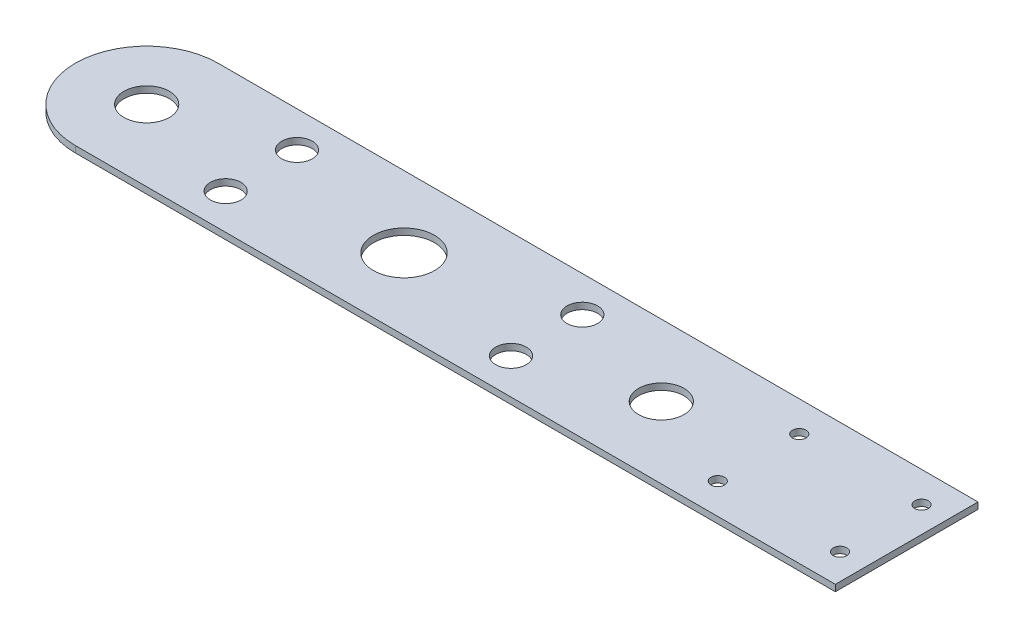
ISO-10303-21;
HEADER;
FILE_DESCRIPTION(('STEP AP214'),'2;1');
FILE_NAME('part.step','',(''),(''),'','','');
FILE_SCHEMA(('AUTOMOTIVE_DESIGN { 1 0 10303 214 1 1 1 1 }'));
ENDSEC;
DATA;
#1=APPLICATION_CONTEXT('core data for automotive mechanical design processes');
#2=APPLICATION_PROTOCOL_DEFINITION('international standard','automotive_design',2000,#1);
#3=PRODUCT_CONTEXT('',#1,'mechanical');
#4=PRODUCT('Part','Part','',(#3));
#5=PRODUCT_RELATED_PRODUCT_CATEGORY('part','',(#4));
#6=PRODUCT_DEFINITION_FORMATION('','',#4);
#7=PRODUCT_DEFINITION_CONTEXT('part definition',#1,'design');
#8=PRODUCT_DEFINITION('design','',#6,#7);
#9=PRODUCT_DEFINITION_SHAPE('','',#8);
#10=(LENGTH_UNIT() NAMED_UNIT(*) SI_UNIT(.MILLI.,.METRE.));
#11=(NAMED_UNIT(*) PLANE_ANGLE_UNIT() SI_UNIT($,.RADIAN.));
#12=(NAMED_UNIT(*) SI_UNIT($,.STERADIAN.) SOLID_ANGLE_UNIT());
#13=UNCERTAINTY_MEASURE_WITH_UNIT(LENGTH_MEASURE(1.E-05),#10,'distance_accuracy_value','');
#14=(GEOMETRIC_REPRESENTATION_CONTEXT(3) GLOBAL_UNCERTAINTY_ASSIGNED_CONTEXT((#13)) GLOBAL_UNIT_ASSIGNED_CONTEXT((#10,
#11,#12)) REPRESENTATION_CONTEXT('',''));
#15=CARTESIAN_POINT('',(0.,0.,0.));
#16=DIRECTION('',(0.,0.,1.));
#17=DIRECTION('',(1.,0.,0.));
#18=AXIS2_PLACEMENT_3D('',#15,#16,#17);
#19=CARTESIAN_POINT('',(0.,3.175,-35.0000000000003));
#20=DIRECTION('',(0.,0.,-1.));
#21=DIRECTION('',(-1.,0.,0.));
#22=AXIS2_PLACEMENT_3D('',#19,#20,#21);
#23=PLANE('',#22);
#24=DIRECTION('',(1.,0.,0.));
#25=VECTOR('',#24,1.);
#26=CARTESIAN_POINT('',(0.,0.,-35.0000000000003));
#27=LINE('',#26,#25);
#28=CARTESIAN_POINT('',(-126.258214395413,0.,-35.0000000000012));
#29=VERTEX_POINT('',#28);
#30=CARTESIAN_POINT('',(246.658214395413,0.,-35.));
#31=VERTEX_POINT('',#30);
#32=EDGE_CURVE('E138',#29,#31,#27,.T.);
#33=ORIENTED_EDGE('',*,*,#32,.F.);
#34=DIRECTION('',(0.,-1.,0.));
#35=VECTOR('',#34,1.);
#36=CARTESIAN_POINT('',(-126.258214395413,3.175,-35.0000000000012));
#37=LINE('',#36,#35);
#38=CARTESIAN_POINT('',(-126.258214395413,3.175,-35.0000000000012));
#39=VERTEX_POINT('',#38);
#40=EDGE_CURVE('E11',#39,#29,#37,.T.);
#41=ORIENTED_EDGE('',*,*,#40,.F.);
#42=DIRECTION('',(1.,0.,0.));
#43=VECTOR('',#42,1.);
#44=CARTESIAN_POINT('',(0.,3.175,-35.0000000000003));
#45=LINE('',#44,#43);
#46=CARTESIAN_POINT('',(246.658214395413,3.175,-35.));
#47=VERTEX_POINT('',#46);
#48=EDGE_CURVE('E91',#39,#47,#45,.T.);
#49=ORIENTED_EDGE('',*,*,#48,.T.);
#50=DIRECTION('',(0.,-1.,0.));
#51=VECTOR('',#50,1.);
#52=CARTESIAN_POINT('',(246.658214395413,3.175,-35.));
#53=LINE('',#52,#51);
#54=EDGE_CURVE('E52',#47,#31,#53,.T.);
#55=ORIENTED_EDGE('',*,*,#54,.T.);
#56=EDGE_LOOP('',(#33,#41,#49,#55));
#57=FACE_BOUND('',#56,.T.);
#58=ADVANCED_FACE('F35',(#57),#23,.T.);
#59=CARTESIAN_POINT('',(-126.258214395413,3.175,-2.40182936781888E-12));
#60=DIRECTION('',(0.,-1.,0.));
#61=DIRECTION('',(0.,0.,-1.));
#62=AXIS2_PLACEMENT_3D('',#59,#60,#61);
#63=CYLINDRICAL_SURFACE('',#62,35.);
#64=CARTESIAN_POINT('',(-126.258214395413,0.,-2.40182936781888E-12));
#65=DIRECTION('',(0.,1.,0.));
#66=DIRECTION('',(0.,0.,1.));
#67=AXIS2_PLACEMENT_3D('',#64,#65,#66);
#68=CIRCLE('',#67,35.);
#69=CARTESIAN_POINT('',(-126.258214395413,0.,34.9999999999988));
#70=VERTEX_POINT('',#69);
#71=EDGE_CURVE('E96',#29,#70,#68,.T.);
#72=ORIENTED_EDGE('',*,*,#71,.T.);
#73=DIRECTION('',(0.,-1.,0.));
#74=VECTOR('',#73,1.);
#75=CARTESIAN_POINT('',(-126.258214395413,3.175,34.9999999999988));
#76=LINE('',#75,#74);
#77=CARTESIAN_POINT('',(-126.258214395413,3.175,34.9999999999988));
#78=VERTEX_POINT('',#77);
#79=EDGE_CURVE('E44',#78,#70,#76,.T.);
#80=ORIENTED_EDGE('',*,*,#79,.F.);
#81=CARTESIAN_POINT('',(-126.258214395413,3.175,-2.40182936781888E-12));
#82=DIRECTION('',(0.,1.,0.));
#83=DIRECTION('',(0.,0.,1.));
#84=AXIS2_PLACEMENT_3D('',#81,#82,#83);
#85=CIRCLE('',#84,35.);
#86=EDGE_CURVE('E86',#39,#78,#85,.T.);
#87=ORIENTED_EDGE('',*,*,#86,.F.);
#88=ORIENTED_EDGE('',*,*,#40,.T.);
#89=EDGE_LOOP('',(#72,#80,#87,#88));
#90=FACE_BOUND('',#89,.T.);
#91=ADVANCED_FACE('F94',(#90),#63,.T.);
#92=CARTESIAN_POINT('',(0.,3.175,35.));
#93=DIRECTION('',(0.,0.,-1.));
#94=DIRECTION('',(-1.,0.,0.));
#95=AXIS2_PLACEMENT_3D('',#92,#93,#94);
#96=PLANE('',#95);
#97=DIRECTION('',(1.,0.,0.));
#98=VECTOR('',#97,1.);
#99=CARTESIAN_POINT('',(0.,0.,35.));
#100=LINE('',#99,#98);
#101=CARTESIAN_POINT('',(246.658214395413,0.,35.));
#102=VERTEX_POINT('',#101);
#103=EDGE_CURVE('E135',#70,#102,#100,.T.);
#104=ORIENTED_EDGE('',*,*,#103,.T.);
#105=DIRECTION('',(0.,-1.,0.));
#106=VECTOR('',#105,1.);
#107=CARTESIAN_POINT('',(246.658214395413,3.175,35.));
#108=LINE('',#107,#106);
#109=CARTESIAN_POINT('',(246.658214395413,3.175,35.));
#110=VERTEX_POINT('',#109);
#111=EDGE_CURVE('E66',#110,#102,#108,.T.);
#112=ORIENTED_EDGE('',*,*,#111,.F.);
#113=DIRECTION('',(1.,0.,0.));
#114=VECTOR('',#113,1.);
#115=CARTESIAN_POINT('',(0.,3.175,35.));
#116=LINE('',#115,#114);
#117=EDGE_CURVE('E78',#78,#110,#116,.T.);
#118=ORIENTED_EDGE('',*,*,#117,.F.);
#119=ORIENTED_EDGE('',*,*,#79,.T.);
#120=EDGE_LOOP('',(#104,#112,#118,#119));
#121=FACE_BOUND('',#120,.T.);
#122=ADVANCED_FACE('F80',(#121),#96,.F.);
#123=CARTESIAN_POINT('',(126.258214395413,3.175,-2.4482158832565E-12));
#124=DIRECTION('',(0.,-1.,0.));
#125=DIRECTION('',(0.,0.,-1.));
#126=AXIS2_PLACEMENT_3D('',#123,#124,#125);
#127=CYLINDRICAL_SURFACE('',#126,11.15);
#128=CARTESIAN_POINT('',(126.258214395413,3.175,-2.4482158832565E-12));
#129=DIRECTION('',(0.,1.,0.));
#130=DIRECTION('',(0.,0.,1.));
#131=AXIS2_PLACEMENT_3D('',#128,#129,#130);
#132=CIRCLE('',#131,11.15);
#133=CARTESIAN_POINT('',(126.258214395413,3.175,11.1499999999975));
#134=VERTEX_POINT('',#133);
#135=EDGE_CURVE('E145',#134,#134,#132,.T.);
#136=ORIENTED_EDGE('',*,*,#135,.T.);
#137=EDGE_LOOP('',(#136));
#138=FACE_BOUND('',#137,.T.);
#139=CARTESIAN_POINT('',(126.258214395413,0.,-2.4482158832565E-12));
#140=DIRECTION('',(0.,1.,0.));
#141=DIRECTION('',(0.,0.,1.));
#142=AXIS2_PLACEMENT_3D('',#139,#140,#141);
#143=CIRCLE('',#142,11.15);
#144=CARTESIAN_POINT('',(126.258214395413,0.,11.1499999999975));
#145=VERTEX_POINT('',#144);
#146=EDGE_CURVE('E105',#145,#145,#143,.T.);
#147=ORIENTED_EDGE('',*,*,#146,.F.);
#148=EDGE_LOOP('',(#147));
#149=FACE_BOUND('',#148,.T.);
#150=ADVANCED_FACE('F199',(#138,#149),#127,.F.);
#151=CARTESIAN_POINT('',(-70.,3.175,17.5));
#152=DIRECTION('',(0.,-1.,0.));
#153=DIRECTION('',(0.,0.,-1.));
#154=AXIS2_PLACEMENT_3D('',#151,#152,#153);
#155=CYLINDRICAL_SURFACE('',#154,7.50000000000001);
#156=CARTESIAN_POINT('',(-70.,3.175,17.5));
#157=DIRECTION('',(0.,1.,0.));
#158=DIRECTION('',(0.,0.,1.));
#159=AXIS2_PLACEMENT_3D('',#156,#157,#158);
#160=CIRCLE('',#159,7.50000000000001);
#161=CARTESIAN_POINT('',(-70.,3.175,25.));
#162=VERTEX_POINT('',#161);
#163=EDGE_CURVE('E148',#162,#162,#160,.T.);
#164=ORIENTED_EDGE('',*,*,#163,.T.);
#165=EDGE_LOOP('',(#164));
#166=FACE_BOUND('',#165,.T.);
#167=CARTESIAN_POINT('',(-70.,0.,17.5));
#168=DIRECTION('',(0.,1.,0.));
#169=DIRECTION('',(0.,0.,1.));
#170=AXIS2_PLACEMENT_3D('',#167,#168,#169);
#171=CIRCLE('',#170,7.50000000000001);
#172=CARTESIAN_POINT('',(-70.,0.,25.));
#173=VERTEX_POINT('',#172);
#174=EDGE_CURVE('E108',#173,#173,#171,.T.);
#175=ORIENTED_EDGE('',*,*,#174,.F.);
#176=EDGE_LOOP('',(#175));
#177=FACE_BOUND('',#176,.T.);
#178=ADVANCED_FACE('F230',(#166,#177),#155,.F.);
#179=CARTESIAN_POINT('',(-70.,3.175,-17.5));
#180=DIRECTION('',(0.,-1.,0.));
#181=DIRECTION('',(0.,0.,-1.));
#182=AXIS2_PLACEMENT_3D('',#179,#180,#181);
#183=CYLINDRICAL_SURFACE('',#182,7.50000000000001);
#184=CARTESIAN_POINT('',(-70.,3.175,-17.5));
#185=DIRECTION('',(0.,1.,0.));
#186=DIRECTION('',(0.,0.,1.));
#187=AXIS2_PLACEMENT_3D('',#184,#185,#186);
#188=CIRCLE('',#187,7.50000000000001);
#189=CARTESIAN_POINT('',(-70.,3.175,-9.99999999999999));
#190=VERTEX_POINT('',#189);
#191=EDGE_CURVE('E151',#190,#190,#188,.T.);
#192=ORIENTED_EDGE('',*,*,#191,.T.);
#193=EDGE_LOOP('',(#192));
#194=FACE_BOUND('',#193,.T.);
#195=CARTESIAN_POINT('',(-70.,0.,-17.5));
#196=DIRECTION('',(0.,1.,0.));
#197=DIRECTION('',(0.,0.,1.));
#198=AXIS2_PLACEMENT_3D('',#195,#196,#197);
#199=CIRCLE('',#198,7.50000000000001);
#200=CARTESIAN_POINT('',(-70.,0.,-9.99999999999999));
#201=VERTEX_POINT('',#200);
#202=EDGE_CURVE('E111',#201,#201,#199,.T.);
#203=ORIENTED_EDGE('',*,*,#202,.F.);
#204=EDGE_LOOP('',(#203));
#205=FACE_BOUND('',#204,.T.);
#206=ADVANCED_FACE('F226',(#194,#205),#183,.F.);
#207=CARTESIAN_POINT('',(70.,3.175,-17.5));
#208=DIRECTION('',(0.,-1.,0.));
#209=DIRECTION('',(0.,0.,-1.));
#210=AXIS2_PLACEMENT_3D('',#207,#208,#209);
#211=CYLINDRICAL_SURFACE('',#210,7.50000000000001);
#212=CARTESIAN_POINT('',(70.,3.175,-17.5));
#213=DIRECTION('',(0.,1.,0.));
#214=DIRECTION('',(0.,0.,1.));
#215=AXIS2_PLACEMENT_3D('',#212,#213,#214);
#216=CIRCLE('',#215,7.50000000000001);
#217=CARTESIAN_POINT('',(70.,3.175,-10.));
#218=VERTEX_POINT('',#217);
#219=EDGE_CURVE('E154',#218,#218,#216,.T.);
#220=ORIENTED_EDGE('',*,*,#219,.T.);
#221=EDGE_LOOP('',(#220));
#222=FACE_BOUND('',#221,.T.);
#223=CARTESIAN_POINT('',(70.,0.,-17.5));
#224=DIRECTION('',(0.,1.,0.));
#225=DIRECTION('',(0.,0.,1.));
#226=AXIS2_PLACEMENT_3D('',#223,#224,#225);
#227=CIRCLE('',#226,7.50000000000001);
#228=CARTESIAN_POINT('',(70.,0.,-10.));
#229=VERTEX_POINT('',#228);
#230=EDGE_CURVE('E114',#229,#229,#227,.T.);
#231=ORIENTED_EDGE('',*,*,#230,.F.);
#232=EDGE_LOOP('',(#231));
#233=FACE_BOUND('',#232,.T.);
#234=ADVANCED_FACE('F222',(#222,#233),#211,.F.);
#235=CARTESIAN_POINT('',(70.,3.175,17.5));
#236=DIRECTION('',(0.,-1.,0.));
#237=DIRECTION('',(0.,0.,-1.));
#238=AXIS2_PLACEMENT_3D('',#235,#236,#237);
#239=CYLINDRICAL_SURFACE('',#238,7.50000000000001);
#240=CARTESIAN_POINT('',(70.,3.175,17.5));
#241=DIRECTION('',(0.,1.,0.));
#242=DIRECTION('',(0.,0.,1.));
#243=AXIS2_PLACEMENT_3D('',#240,#241,#242);
#244=CIRCLE('',#243,7.50000000000001);
#245=CARTESIAN_POINT('',(70.,3.175,25.));
#246=VERTEX_POINT('',#245);
#247=EDGE_CURVE('E157',#246,#246,#244,.T.);
#248=ORIENTED_EDGE('',*,*,#247,.T.);
#249=EDGE_LOOP('',(#248));
#250=FACE_BOUND('',#249,.T.);
#251=CARTESIAN_POINT('',(70.,0.,17.5));
#252=DIRECTION('',(0.,1.,0.));
#253=DIRECTION('',(0.,0.,1.));
#254=AXIS2_PLACEMENT_3D('',#251,#252,#253);
#255=CIRCLE('',#254,7.50000000000001);
#256=CARTESIAN_POINT('',(70.,0.,25.));
#257=VERTEX_POINT('',#256);
#258=EDGE_CURVE('E117',#257,#257,#255,.T.);
#259=ORIENTED_EDGE('',*,*,#258,.F.);
#260=EDGE_LOOP('',(#259));
#261=FACE_BOUND('',#260,.T.);
#262=ADVANCED_FACE('F218',(#250,#261),#239,.F.);
#263=CARTESIAN_POINT('',(233.958214395413,3.175,20.));
#264=DIRECTION('',(0.,-1.,0.));
#265=DIRECTION('',(0.,0.,-1.));
#266=AXIS2_PLACEMENT_3D('',#263,#264,#265);
#267=CYLINDRICAL_SURFACE('',#266,3.32499999999999);
#268=CARTESIAN_POINT('',(233.958214395413,3.175,20.));
#269=DIRECTION('',(0.,1.,0.));
#270=DIRECTION('',(0.,0.,1.));
#271=AXIS2_PLACEMENT_3D('',#268,#269,#270);
#272=CIRCLE('',#271,3.32499999999999);
#273=CARTESIAN_POINT('',(233.958214395413,3.175,23.325));
#274=VERTEX_POINT('',#273);
#275=EDGE_CURVE('E160',#274,#274,#272,.T.);
#276=ORIENTED_EDGE('',*,*,#275,.T.);
#277=EDGE_LOOP('',(#276));
#278=FACE_BOUND('',#277,.T.);
#279=CARTESIAN_POINT('',(233.958214395413,0.,20.));
#280=DIRECTION('',(0.,1.,0.));
#281=DIRECTION('',(0.,0.,1.));
#282=AXIS2_PLACEMENT_3D('',#279,#280,#281);
#283=CIRCLE('',#282,3.32499999999999);
#284=CARTESIAN_POINT('',(233.958214395413,0.,23.325));
#285=VERTEX_POINT('',#284);
#286=EDGE_CURVE('E120',#285,#285,#283,.T.);
#287=ORIENTED_EDGE('',*,*,#286,.F.);
#288=EDGE_LOOP('',(#287));
#289=FACE_BOUND('',#288,.T.);
#290=ADVANCED_FACE('F214',(#278,#289),#267,.F.);
#291=CARTESIAN_POINT('',(233.958214395413,3.175,-20.));
#292=DIRECTION('',(0.,-1.,0.));
#293=DIRECTION('',(0.,0.,-1.));
#294=AXIS2_PLACEMENT_3D('',#291,#292,#293);
#295=CYLINDRICAL_SURFACE('',#294,3.32499999999999);
#296=CARTESIAN_POINT('',(233.958214395413,3.175,-20.));
#297=DIRECTION('',(0.,1.,0.));
#298=DIRECTION('',(0.,0.,1.));
#299=AXIS2_PLACEMENT_3D('',#296,#297,#298);
#300=CIRCLE('',#299,3.32499999999999);
#301=CARTESIAN_POINT('',(233.958214395413,3.175,-16.675));
#302=VERTEX_POINT('',#301);
#303=EDGE_CURVE('E163',#302,#302,#300,.T.);
#304=ORIENTED_EDGE('',*,*,#303,.T.);
#305=EDGE_LOOP('',(#304));
#306=FACE_BOUND('',#305,.T.);
#307=CARTESIAN_POINT('',(233.958214395413,0.,-20.));
#308=DIRECTION('',(0.,1.,0.));
#309=DIRECTION('',(0.,0.,1.));
#310=AXIS2_PLACEMENT_3D('',#307,#308,#309);
#311=CIRCLE('',#310,3.32499999999999);
#312=CARTESIAN_POINT('',(233.958214395413,0.,-16.675));
#313=VERTEX_POINT('',#312);
#314=EDGE_CURVE('E123',#313,#313,#311,.T.);
#315=ORIENTED_EDGE('',*,*,#314,.F.);
#316=EDGE_LOOP('',(#315));
#317=FACE_BOUND('',#316,.T.);
#318=ADVANCED_FACE('F210',(#306,#317),#295,.F.);
#319=CARTESIAN_POINT('',(173.958214395413,3.175,-20.));
#320=DIRECTION('',(0.,-1.,0.));
#321=DIRECTION('',(0.,0.,-1.));
#322=AXIS2_PLACEMENT_3D('',#319,#320,#321);
#323=CYLINDRICAL_SURFACE('',#322,3.32499999999999);
#324=CARTESIAN_POINT('',(173.958214395413,3.175,-20.));
#325=DIRECTION('',(0.,1.,0.));
#326=DIRECTION('',(0.,0.,1.));
#327=AXIS2_PLACEMENT_3D('',#324,#325,#326);
#328=CIRCLE('',#327,3.32499999999999);
#329=CARTESIAN_POINT('',(173.958214395413,3.175,-16.675));
#330=VERTEX_POINT('',#329);
#331=EDGE_CURVE('E166',#330,#330,#328,.T.);
#332=ORIENTED_EDGE('',*,*,#331,.T.);
#333=EDGE_LOOP('',(#332));
#334=FACE_BOUND('',#333,.T.);
#335=CARTESIAN_POINT('',(173.958214395413,0.,-20.));
#336=DIRECTION('',(0.,1.,0.));
#337=DIRECTION('',(0.,0.,1.));
#338=AXIS2_PLACEMENT_3D('',#335,#336,#337);
#339=CIRCLE('',#338,3.32499999999999);
#340=CARTESIAN_POINT('',(173.958214395413,0.,-16.675));
#341=VERTEX_POINT('',#340);
#342=EDGE_CURVE('E126',#341,#341,#339,.T.);
#343=ORIENTED_EDGE('',*,*,#342,.F.);
#344=EDGE_LOOP('',(#343));
#345=FACE_BOUND('',#344,.T.);
#346=ADVANCED_FACE('F206',(#334,#345),#323,.F.);
#347=CARTESIAN_POINT('',(173.958214395413,3.175,20.));
#348=DIRECTION('',(0.,-1.,0.));
#349=DIRECTION('',(0.,0.,-1.));
#350=AXIS2_PLACEMENT_3D('',#347,#348,#349);
#351=CYLINDRICAL_SURFACE('',#350,3.32499999999999);
#352=CARTESIAN_POINT('',(173.958214395413,3.175,20.));
#353=DIRECTION('',(0.,1.,0.));
#354=DIRECTION('',(0.,0.,1.));
#355=AXIS2_PLACEMENT_3D('',#352,#353,#354);
#356=CIRCLE('',#355,3.32499999999999);
#357=CARTESIAN_POINT('',(173.958214395413,3.175,23.325));
#358=VERTEX_POINT('',#357);
#359=EDGE_CURVE('E169',#358,#358,#356,.T.);
#360=ORIENTED_EDGE('',*,*,#359,.T.);
#361=EDGE_LOOP('',(#360));
#362=FACE_BOUND('',#361,.T.);
#363=CARTESIAN_POINT('',(173.958214395413,0.,20.));
#364=DIRECTION('',(0.,1.,0.));
#365=DIRECTION('',(0.,0.,1.));
#366=AXIS2_PLACEMENT_3D('',#363,#364,#365);
#367=CIRCLE('',#366,3.32499999999999);
#368=CARTESIAN_POINT('',(173.958214395413,0.,23.325));
#369=VERTEX_POINT('',#368);
#370=EDGE_CURVE('E129',#369,#369,#367,.T.);
#371=ORIENTED_EDGE('',*,*,#370,.F.);
#372=EDGE_LOOP('',(#371));
#373=FACE_BOUND('',#372,.T.);
#374=ADVANCED_FACE('F203',(#362,#373),#351,.F.);
#375=CARTESIAN_POINT('',(246.658214395413,3.175,0.));
#376=DIRECTION('',(1.,0.,0.));
#377=DIRECTION('',(0.,0.,-1.));
#378=AXIS2_PLACEMENT_3D('',#375,#376,#377);
#379=PLANE('',#378);
#380=DIRECTION('',(0.,0.,1.));
#381=VECTOR('',#380,1.);
#382=CARTESIAN_POINT('',(246.658214395413,0.,0.));
#383=LINE('',#382,#381);
#384=EDGE_CURVE('E132',#31,#102,#383,.T.);
#385=ORIENTED_EDGE('',*,*,#384,.F.);
#386=ORIENTED_EDGE('',*,*,#54,.F.);
#387=DIRECTION('',(0.,0.,1.));
#388=VECTOR('',#387,1.);
#389=CARTESIAN_POINT('',(246.658214395413,3.175,0.));
#390=LINE('',#389,#388);
#391=EDGE_CURVE('E85',#47,#110,#390,.T.);
#392=ORIENTED_EDGE('',*,*,#391,.T.);
#393=ORIENTED_EDGE('',*,*,#111,.T.);
#394=EDGE_LOOP('',(#385,#386,#392,#393));
#395=FACE_BOUND('',#394,.T.);
#396=ADVANCED_FACE('F200',(#395),#379,.T.);
#397=CARTESIAN_POINT('',(0.,3.175,0.));
#398=DIRECTION('',(0.,-1.,0.));
#399=DIRECTION('',(0.,0.,-1.));
#400=AXIS2_PLACEMENT_3D('',#397,#398,#399);
#401=CYLINDRICAL_SURFACE('',#400,15.);
#402=CARTESIAN_POINT('',(0.,3.175,0.));
#403=DIRECTION('',(0.,1.,0.));
#404=DIRECTION('',(0.,0.,1.));
#405=AXIS2_PLACEMENT_3D('',#402,#403,#404);
#406=CIRCLE('',#405,15.);
#407=CARTESIAN_POINT('',(0.,3.175,15.));
#408=VERTEX_POINT('',#407);
#409=EDGE_CURVE('E104',#408,#408,#406,.T.);
#410=ORIENTED_EDGE('',*,*,#409,.T.);
#411=EDGE_LOOP('',(#410));
#412=FACE_BOUND('',#411,.T.);
#413=CARTESIAN_POINT('',(0.,0.,0.));
#414=DIRECTION('',(0.,1.,0.));
#415=DIRECTION('',(0.,0.,1.));
#416=AXIS2_PLACEMENT_3D('',#413,#414,#415);
#417=CIRCLE('',#416,15.);
#418=CARTESIAN_POINT('',(0.,0.,15.));
#419=VERTEX_POINT('',#418);
#420=EDGE_CURVE('E140',#419,#419,#417,.T.);
#421=ORIENTED_EDGE('',*,*,#420,.F.);
#422=EDGE_LOOP('',(#421));
#423=FACE_BOUND('',#422,.T.);
#424=ADVANCED_FACE('F37',(#412,#423),#401,.F.);
#425=CARTESIAN_POINT('',(-126.258214395413,3.175,-2.40182936781888E-12));
#426=DIRECTION('',(0.,-1.,0.));
#427=DIRECTION('',(0.,0.,-1.));
#428=AXIS2_PLACEMENT_3D('',#425,#426,#427);
#429=CYLINDRICAL_SURFACE('',#428,11.15);
#430=CARTESIAN_POINT('',(-126.258214395413,3.175,-2.40182936781888E-12));
#431=DIRECTION('',(0.,1.,0.));
#432=DIRECTION('',(0.,0.,1.));
#433=AXIS2_PLACEMENT_3D('',#430,#431,#432);
#434=CIRCLE('',#433,11.15);
#435=CARTESIAN_POINT('',(-126.258214395413,3.175,11.1499999999976));
#436=VERTEX_POINT('',#435);
#437=EDGE_CURVE('E100',#436,#436,#434,.T.);
#438=ORIENTED_EDGE('',*,*,#437,.T.);
#439=EDGE_LOOP('',(#438));
#440=FACE_BOUND('',#439,.T.);
#441=CARTESIAN_POINT('',(-126.258214395413,0.,-2.40182936781888E-12));
#442=DIRECTION('',(0.,1.,0.));
#443=DIRECTION('',(0.,0.,1.));
#444=AXIS2_PLACEMENT_3D('',#441,#442,#443);
#445=CIRCLE('',#444,11.15);
#446=CARTESIAN_POINT('',(-126.258214395413,0.,11.1499999999976));
#447=VERTEX_POINT('',#446);
#448=EDGE_CURVE('E101',#447,#447,#445,.T.);
#449=ORIENTED_EDGE('',*,*,#448,.F.);
#450=EDGE_LOOP('',(#449));
#451=FACE_BOUND('',#450,.T.);
#452=ADVANCED_FACE('F181',(#440,#451),#429,.F.);
#453=CARTESIAN_POINT('',(0.,3.175,0.));
#454=DIRECTION('',(0.,1.,0.));
#455=DIRECTION('',(0.,0.,1.));
#456=AXIS2_PLACEMENT_3D('',#453,#454,#455);
#457=PLANE('',#456);
#458=ORIENTED_EDGE('',*,*,#409,.F.);
#459=EDGE_LOOP('',(#458));
#460=FACE_BOUND('',#459,.T.);
#461=ORIENTED_EDGE('',*,*,#48,.F.);
#462=ORIENTED_EDGE('',*,*,#86,.T.);
#463=ORIENTED_EDGE('',*,*,#117,.T.);
#464=ORIENTED_EDGE('',*,*,#391,.F.);
#465=EDGE_LOOP('',(#461,#462,#463,#464));
#466=FACE_BOUND('',#465,.T.);
#467=ORIENTED_EDGE('',*,*,#359,.F.);
#468=EDGE_LOOP('',(#467));
#469=FACE_BOUND('',#468,.T.);
#470=ORIENTED_EDGE('',*,*,#331,.F.);
#471=EDGE_LOOP('',(#470));
#472=FACE_BOUND('',#471,.T.);
#473=ORIENTED_EDGE('',*,*,#303,.F.);
#474=EDGE_LOOP('',(#473));
#475=FACE_BOUND('',#474,.T.);
#476=ORIENTED_EDGE('',*,*,#275,.F.);
#477=EDGE_LOOP('',(#476));
#478=FACE_BOUND('',#477,.T.);
#479=ORIENTED_EDGE('',*,*,#247,.F.);
#480=EDGE_LOOP('',(#479));
#481=FACE_BOUND('',#480,.T.);
#482=ORIENTED_EDGE('',*,*,#219,.F.);
#483=EDGE_LOOP('',(#482));
#484=FACE_BOUND('',#483,.T.);
#485=ORIENTED_EDGE('',*,*,#191,.F.);
#486=EDGE_LOOP('',(#485));
#487=FACE_BOUND('',#486,.T.);
#488=ORIENTED_EDGE('',*,*,#163,.F.);
#489=EDGE_LOOP('',(#488));
#490=FACE_BOUND('',#489,.T.);
#491=ORIENTED_EDGE('',*,*,#135,.F.);
#492=EDGE_LOOP('',(#491));
#493=FACE_BOUND('',#492,.T.);
#494=ORIENTED_EDGE('',*,*,#437,.F.);
#495=EDGE_LOOP('',(#494));
#496=FACE_BOUND('',#495,.T.);
#497=ADVANCED_FACE('F89',(#460,#466,#469,#472,#475,#478,#481,#484,#487,#490,#493,#496),#457,.T.);
#498=CARTESIAN_POINT('',(0.,0.,0.));
#499=DIRECTION('',(0.,1.,0.));
#500=DIRECTION('',(0.,0.,1.));
#501=AXIS2_PLACEMENT_3D('',#498,#499,#500);
#502=PLANE('',#501);
#503=ORIENTED_EDGE('',*,*,#420,.T.);
#504=EDGE_LOOP('',(#503));
#505=FACE_BOUND('',#504,.T.);
#506=ORIENTED_EDGE('',*,*,#32,.T.);
#507=ORIENTED_EDGE('',*,*,#384,.T.);
#508=ORIENTED_EDGE('',*,*,#103,.F.);
#509=ORIENTED_EDGE('',*,*,#71,.F.);
#510=EDGE_LOOP('',(#506,#507,#508,#509));
#511=FACE_BOUND('',#510,.T.);
#512=ORIENTED_EDGE('',*,*,#370,.T.);
#513=EDGE_LOOP('',(#512));
#514=FACE_BOUND('',#513,.T.);
#515=ORIENTED_EDGE('',*,*,#342,.T.);
#516=EDGE_LOOP('',(#515));
#517=FACE_BOUND('',#516,.T.);
#518=ORIENTED_EDGE('',*,*,#314,.T.);
#519=EDGE_LOOP('',(#518));
#520=FACE_BOUND('',#519,.T.);
#521=ORIENTED_EDGE('',*,*,#286,.T.);
#522=EDGE_LOOP('',(#521));
#523=FACE_BOUND('',#522,.T.);
#524=ORIENTED_EDGE('',*,*,#258,.T.);
#525=EDGE_LOOP('',(#524));
#526=FACE_BOUND('',#525,.T.);
#527=ORIENTED_EDGE('',*,*,#230,.T.);
#528=EDGE_LOOP('',(#527));
#529=FACE_BOUND('',#528,.T.);
#530=ORIENTED_EDGE('',*,*,#202,.T.);
#531=EDGE_LOOP('',(#530));
#532=FACE_BOUND('',#531,.T.);
#533=ORIENTED_EDGE('',*,*,#174,.T.);
#534=EDGE_LOOP('',(#533));
#535=FACE_BOUND('',#534,.T.);
#536=ORIENTED_EDGE('',*,*,#146,.T.);
#537=EDGE_LOOP('',(#536));
#538=FACE_BOUND('',#537,.T.);
#539=ORIENTED_EDGE('',*,*,#448,.T.);
#540=EDGE_LOOP('',(#539));
#541=FACE_BOUND('',#540,.T.);
#542=ADVANCED_FACE('F180',(#505,#511,#514,#517,#520,#523,#526,#529,#532,#535,#538,#541),#502,.F.);
#543=CLOSED_SHELL('',(#58,#91,#122,#150,#178,#206,#234,#262,#290,#318,#346,#374,#396,#424,#452,
#497,#542));
#544=MANIFOLD_SOLID_BREP('B2',#543);
#545=ADVANCED_BREP_SHAPE_REPRESENTATION('',(#18,#544),#14);
#546=SHAPE_DEFINITION_REPRESENTATION(#9,#545);
ENDSEC;
END-ISO-10303-21;
